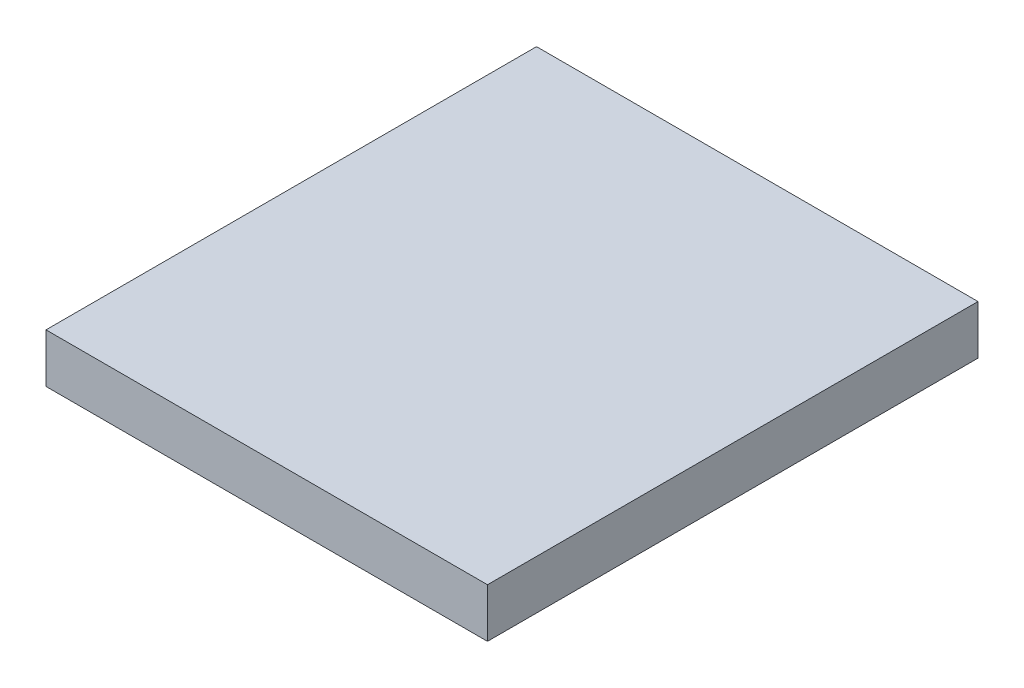
ISO-10303-21;
HEADER;
FILE_DESCRIPTION(('STEP AP214'),'2;1');
FILE_NAME('part.step','',(''),(''),'','','');
FILE_SCHEMA(('AUTOMOTIVE_DESIGN { 1 0 10303 214 1 1 1 1 }'));
ENDSEC;
DATA;
#1=APPLICATION_CONTEXT('core data for automotive mechanical design processes');
#2=APPLICATION_PROTOCOL_DEFINITION('international standard','automotive_design',2000,#1);
#3=PRODUCT_CONTEXT('',#1,'mechanical');
#4=PRODUCT('Part','Part','',(#3));
#5=PRODUCT_RELATED_PRODUCT_CATEGORY('part','',(#4));
#6=PRODUCT_DEFINITION_FORMATION('','',#4);
#7=PRODUCT_DEFINITION_CONTEXT('part definition',#1,'design');
#8=PRODUCT_DEFINITION('design','',#6,#7);
#9=PRODUCT_DEFINITION_SHAPE('','',#8);
#10=(LENGTH_UNIT() NAMED_UNIT(*) SI_UNIT(.MILLI.,.METRE.));
#11=(NAMED_UNIT(*) PLANE_ANGLE_UNIT() SI_UNIT($,.RADIAN.));
#12=(NAMED_UNIT(*) SI_UNIT($,.STERADIAN.) SOLID_ANGLE_UNIT());
#13=UNCERTAINTY_MEASURE_WITH_UNIT(LENGTH_MEASURE(1.E-05),#10,'distance_accuracy_value','');
#14=(GEOMETRIC_REPRESENTATION_CONTEXT(3) GLOBAL_UNCERTAINTY_ASSIGNED_CONTEXT((#13)) GLOBAL_UNIT_ASSIGNED_CONTEXT((#10,
#11,#12)) REPRESENTATION_CONTEXT('',''));
#15=CARTESIAN_POINT('',(0.,0.,0.));
#16=DIRECTION('',(0.,0.,1.));
#17=DIRECTION('',(1.,0.,0.));
#18=AXIS2_PLACEMENT_3D('',#15,#16,#17);
#19=CARTESIAN_POINT('',(9.,2.,-10.));
#20=DIRECTION('',(-1.,0.,0.));
#21=DIRECTION('',(0.,0.,1.));
#22=AXIS2_PLACEMENT_3D('',#19,#20,#21);
#23=PLANE('',#22);
#24=DIRECTION('',(0.,0.,-1.));
#25=VECTOR('',#24,1.);
#26=CARTESIAN_POINT('',(9.,0.,-10.));
#27=LINE('',#26,#25);
#28=CARTESIAN_POINT('',(9.,0.,10.));
#29=VERTEX_POINT('',#28);
#30=CARTESIAN_POINT('',(9.,0.,-10.));
#31=VERTEX_POINT('',#30);
#32=EDGE_CURVE('E96',#29,#31,#27,.T.);
#33=ORIENTED_EDGE('',*,*,#32,.T.);
#34=DIRECTION('',(0.,-1.,0.));
#35=VECTOR('',#34,1.);
#36=CARTESIAN_POINT('',(9.,2.,-10.));
#37=LINE('',#36,#35);
#38=CARTESIAN_POINT('',(9.,2.,-10.));
#39=VERTEX_POINT('',#38);
#40=EDGE_CURVE('E11',#39,#31,#37,.T.);
#41=ORIENTED_EDGE('',*,*,#40,.F.);
#42=DIRECTION('',(0.,0.,-1.));
#43=VECTOR('',#42,1.);
#44=CARTESIAN_POINT('',(9.,2.,-10.));
#45=LINE('',#44,#43);
#46=CARTESIAN_POINT('',(9.,2.,10.));
#47=VERTEX_POINT('',#46);
#48=EDGE_CURVE('E84',#47,#39,#45,.T.);
#49=ORIENTED_EDGE('',*,*,#48,.F.);
#50=DIRECTION('',(0.,-1.,0.));
#51=VECTOR('',#50,1.);
#52=CARTESIAN_POINT('',(9.,2.,10.));
#53=LINE('',#52,#51);
#54=EDGE_CURVE('E92',#47,#29,#53,.T.);
#55=ORIENTED_EDGE('',*,*,#54,.T.);
#56=EDGE_LOOP('',(#33,#41,#49,#55));
#57=FACE_BOUND('',#56,.T.);
#58=ADVANCED_FACE('F33',(#57),#23,.F.);
#59=CARTESIAN_POINT('',(-9.,2.,-10.));
#60=DIRECTION('',(0.,0.,1.));
#61=DIRECTION('',(1.,0.,0.));
#62=AXIS2_PLACEMENT_3D('',#59,#60,#61);
#63=PLANE('',#62);
#64=DIRECTION('',(-1.,0.,0.));
#65=VECTOR('',#64,1.);
#66=CARTESIAN_POINT('',(-9.,0.,-10.));
#67=LINE('',#66,#65);
#68=CARTESIAN_POINT('',(-9.,0.,-10.));
#69=VERTEX_POINT('',#68);
#70=EDGE_CURVE('E88',#31,#69,#67,.T.);
#71=ORIENTED_EDGE('',*,*,#70,.T.);
#72=DIRECTION('',(0.,-1.,0.));
#73=VECTOR('',#72,1.);
#74=CARTESIAN_POINT('',(-9.,2.,-10.));
#75=LINE('',#74,#73);
#76=CARTESIAN_POINT('',(-9.,2.,-10.));
#77=VERTEX_POINT('',#76);
#78=EDGE_CURVE('E41',#77,#69,#75,.T.);
#79=ORIENTED_EDGE('',*,*,#78,.F.);
#80=DIRECTION('',(-1.,0.,0.));
#81=VECTOR('',#80,1.);
#82=CARTESIAN_POINT('',(-9.,2.,-10.));
#83=LINE('',#82,#81);
#84=EDGE_CURVE('E79',#39,#77,#83,.T.);
#85=ORIENTED_EDGE('',*,*,#84,.F.);
#86=ORIENTED_EDGE('',*,*,#40,.T.);
#87=EDGE_LOOP('',(#71,#79,#85,#86));
#88=FACE_BOUND('',#87,.T.);
#89=ADVANCED_FACE('F87',(#88),#63,.F.);
#90=CARTESIAN_POINT('',(-9.,2.,-10.));
#91=DIRECTION('',(1.,0.,0.));
#92=DIRECTION('',(0.,0.,-1.));
#93=AXIS2_PLACEMENT_3D('',#90,#91,#92);
#94=PLANE('',#93);
#95=DIRECTION('',(0.,0.,1.));
#96=VECTOR('',#95,1.);
#97=CARTESIAN_POINT('',(-9.,0.,-10.));
#98=LINE('',#97,#96);
#99=CARTESIAN_POINT('',(-9.,0.,10.));
#100=VERTEX_POINT('',#99);
#101=EDGE_CURVE('E66',#69,#100,#98,.T.);
#102=ORIENTED_EDGE('',*,*,#101,.T.);
#103=DIRECTION('',(0.,-1.,0.));
#104=VECTOR('',#103,1.);
#105=CARTESIAN_POINT('',(-9.,2.,10.));
#106=LINE('',#105,#104);
#107=CARTESIAN_POINT('',(-9.,2.,10.));
#108=VERTEX_POINT('',#107);
#109=EDGE_CURVE('E89',#108,#100,#106,.T.);
#110=ORIENTED_EDGE('',*,*,#109,.F.);
#111=DIRECTION('',(0.,0.,1.));
#112=VECTOR('',#111,1.);
#113=CARTESIAN_POINT('',(-9.,2.,-10.));
#114=LINE('',#113,#112);
#115=EDGE_CURVE('E82',#77,#108,#114,.T.);
#116=ORIENTED_EDGE('',*,*,#115,.F.);
#117=ORIENTED_EDGE('',*,*,#78,.T.);
#118=EDGE_LOOP('',(#102,#110,#116,#117));
#119=FACE_BOUND('',#118,.T.);
#120=ADVANCED_FACE('F90',(#119),#94,.F.);
#121=CARTESIAN_POINT('',(-9.,2.,10.));
#122=DIRECTION('',(0.,0.,-1.));
#123=DIRECTION('',(-1.,0.,0.));
#124=AXIS2_PLACEMENT_3D('',#121,#122,#123);
#125=PLANE('',#124);
#126=DIRECTION('',(1.,0.,0.));
#127=VECTOR('',#126,1.);
#128=CARTESIAN_POINT('',(-9.,0.,10.));
#129=LINE('',#128,#127);
#130=EDGE_CURVE('E72',#100,#29,#129,.T.);
#131=ORIENTED_EDGE('',*,*,#130,.T.);
#132=ORIENTED_EDGE('',*,*,#54,.F.);
#133=DIRECTION('',(1.,0.,0.));
#134=VECTOR('',#133,1.);
#135=CARTESIAN_POINT('',(-9.,2.,10.));
#136=LINE('',#135,#134);
#137=EDGE_CURVE('E49',#108,#47,#136,.T.);
#138=ORIENTED_EDGE('',*,*,#137,.F.);
#139=ORIENTED_EDGE('',*,*,#109,.T.);
#140=EDGE_LOOP('',(#131,#132,#138,#139));
#141=FACE_BOUND('',#140,.T.);
#142=ADVANCED_FACE('F103',(#141),#125,.F.);
#143=CARTESIAN_POINT('',(0.,2.,0.));
#144=DIRECTION('',(0.,1.,0.));
#145=DIRECTION('',(0.,0.,1.));
#146=AXIS2_PLACEMENT_3D('',#143,#144,#145);
#147=PLANE('',#146);
#148=ORIENTED_EDGE('',*,*,#48,.T.);
#149=ORIENTED_EDGE('',*,*,#84,.T.);
#150=ORIENTED_EDGE('',*,*,#115,.T.);
#151=ORIENTED_EDGE('',*,*,#137,.T.);
#152=EDGE_LOOP('',(#148,#149,#150,#151));
#153=FACE_BOUND('',#152,.T.);
#154=ADVANCED_FACE('F80',(#153),#147,.T.);
#155=CARTESIAN_POINT('',(0.,0.,0.));
#156=DIRECTION('',(0.,1.,0.));
#157=DIRECTION('',(0.,0.,1.));
#158=AXIS2_PLACEMENT_3D('',#155,#156,#157);
#159=PLANE('',#158);
#160=ORIENTED_EDGE('',*,*,#32,.F.);
#161=ORIENTED_EDGE('',*,*,#130,.F.);
#162=ORIENTED_EDGE('',*,*,#101,.F.);
#163=ORIENTED_EDGE('',*,*,#70,.F.);
#164=EDGE_LOOP('',(#160,#161,#162,#163));
#165=FACE_BOUND('',#164,.T.);
#166=ADVANCED_FACE('F106',(#165),#159,.F.);
#167=CLOSED_SHELL('',(#58,#89,#120,#142,#154,#166));
#168=MANIFOLD_SOLID_BREP('B2',#167);
#169=ADVANCED_BREP_SHAPE_REPRESENTATION('',(#18,#168),#14);
#170=SHAPE_DEFINITION_REPRESENTATION(#9,#169);
ENDSEC;
END-ISO-10303-21;
